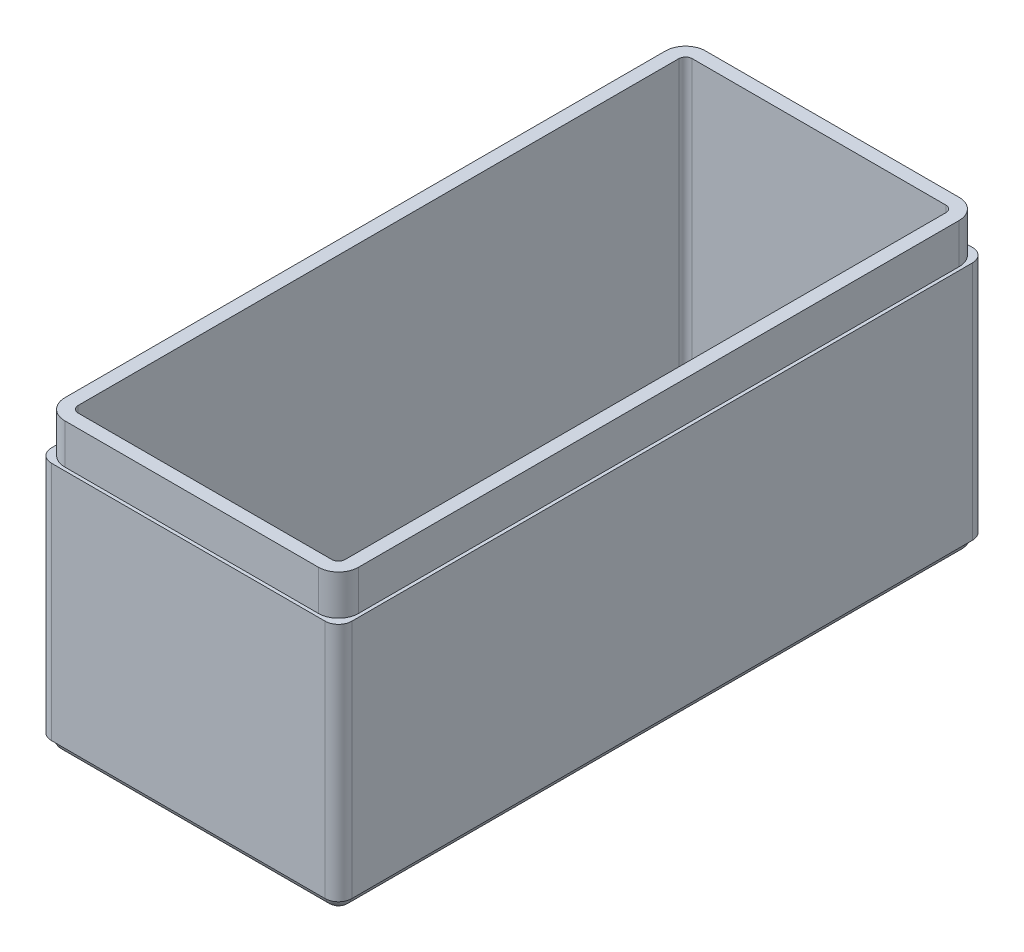
ISO-10303-21;
HEADER;
FILE_DESCRIPTION(('STEP AP214'),'2;1');
FILE_NAME('part.step','',(''),(''),'','','');
FILE_SCHEMA(('AUTOMOTIVE_DESIGN { 1 0 10303 214 1 1 1 1 }'));
ENDSEC;
DATA;
#1=APPLICATION_CONTEXT('core data for automotive mechanical design processes');
#2=APPLICATION_PROTOCOL_DEFINITION('international standard','automotive_design',2000,#1);
#3=PRODUCT_CONTEXT('',#1,'mechanical');
#4=PRODUCT('Part','Part','',(#3));
#5=PRODUCT_RELATED_PRODUCT_CATEGORY('part','',(#4));
#6=PRODUCT_DEFINITION_FORMATION('','',#4);
#7=PRODUCT_DEFINITION_CONTEXT('part definition',#1,'design');
#8=PRODUCT_DEFINITION('design','',#6,#7);
#9=PRODUCT_DEFINITION_SHAPE('','',#8);
#10=(LENGTH_UNIT() NAMED_UNIT(*) SI_UNIT(.MILLI.,.METRE.));
#11=(NAMED_UNIT(*) PLANE_ANGLE_UNIT() SI_UNIT($,.RADIAN.));
#12=(NAMED_UNIT(*) SI_UNIT($,.STERADIAN.) SOLID_ANGLE_UNIT());
#13=UNCERTAINTY_MEASURE_WITH_UNIT(LENGTH_MEASURE(1.E-05),#10,'distance_accuracy_value','');
#14=(GEOMETRIC_REPRESENTATION_CONTEXT(3) GLOBAL_UNCERTAINTY_ASSIGNED_CONTEXT((#13)) GLOBAL_UNIT_ASSIGNED_CONTEXT((#10,
#11,#12)) REPRESENTATION_CONTEXT('',''));
#15=CARTESIAN_POINT('',(0.,0.,0.));
#16=DIRECTION('',(0.,0.,1.));
#17=DIRECTION('',(1.,0.,0.));
#18=AXIS2_PLACEMENT_3D('',#15,#16,#17);
#19=CARTESIAN_POINT('',(22.5,19.,-48.5));
#20=DIRECTION('',(-1.,0.,0.));
#21=DIRECTION('',(0.,0.,1.));
#22=AXIS2_PLACEMENT_3D('',#19,#20,#21);
#23=PLANE('',#22);
#24=DIRECTION('',(0.,0.,-1.));
#25=VECTOR('',#24,1.);
#26=CARTESIAN_POINT('',(22.5,19.,-48.5));
#27=LINE('',#26,#25);
#28=CARTESIAN_POINT('',(22.5,19.,46.5));
#29=VERTEX_POINT('',#28);
#30=CARTESIAN_POINT('',(22.5,19.,-46.5));
#31=VERTEX_POINT('',#30);
#32=EDGE_CURVE('E379',#29,#31,#27,.T.);
#33=ORIENTED_EDGE('',*,*,#32,.F.);
#34=DIRECTION('',(0.,-1.,0.));
#35=VECTOR('',#34,1.);
#36=CARTESIAN_POINT('',(22.5,19.,46.5));
#37=LINE('',#36,#35);
#38=CARTESIAN_POINT('',(22.5,-17.,46.5));
#39=VERTEX_POINT('',#38);
#40=EDGE_CURVE('E554',#29,#39,#37,.T.);
#41=ORIENTED_EDGE('',*,*,#40,.T.);
#42=DIRECTION('',(0.,0.,1.));
#43=VECTOR('',#42,1.);
#44=CARTESIAN_POINT('',(22.5,-17.,-48.5));
#45=LINE('',#44,#43);
#46=CARTESIAN_POINT('',(22.5,-17.,-46.5));
#47=VERTEX_POINT('',#46);
#48=EDGE_CURVE('E349',#47,#39,#45,.T.);
#49=ORIENTED_EDGE('',*,*,#48,.F.);
#50=DIRECTION('',(0.,-1.,0.));
#51=VECTOR('',#50,1.);
#52=CARTESIAN_POINT('',(22.5,19.,-46.5));
#53=LINE('',#52,#51);
#54=EDGE_CURVE('E551',#47,#31,#53,.F.);
#55=ORIENTED_EDGE('',*,*,#54,.T.);
#56=EDGE_LOOP('',(#33,#41,#49,#55));
#57=FACE_BOUND('',#56,.T.);
#58=ADVANCED_FACE('F38',(#57),#23,.F.);
#59=CARTESIAN_POINT('',(-22.5,19.,-48.5));
#60=DIRECTION('',(0.,0.,1.));
#61=DIRECTION('',(1.,0.,0.));
#62=AXIS2_PLACEMENT_3D('',#59,#60,#61);
#63=PLANE('',#62);
#64=DIRECTION('',(1.,0.,0.));
#65=VECTOR('',#64,1.);
#66=CARTESIAN_POINT('',(-22.5,-17.,-48.5));
#67=LINE('',#66,#65);
#68=CARTESIAN_POINT('',(-20.5,-17.,-48.5));
#69=VERTEX_POINT('',#68);
#70=CARTESIAN_POINT('',(20.5,-17.,-48.5));
#71=VERTEX_POINT('',#70);
#72=EDGE_CURVE('E345',#69,#71,#67,.T.);
#73=ORIENTED_EDGE('',*,*,#72,.F.);
#74=DIRECTION('',(0.,-1.,0.));
#75=VECTOR('',#74,1.);
#76=CARTESIAN_POINT('',(-20.5,19.,-48.5));
#77=LINE('',#76,#75);
#78=CARTESIAN_POINT('',(-20.5,19.,-48.5));
#79=VERTEX_POINT('',#78);
#80=EDGE_CURVE('E11',#69,#79,#77,.F.);
#81=ORIENTED_EDGE('',*,*,#80,.T.);
#82=DIRECTION('',(-1.,0.,0.));
#83=VECTOR('',#82,1.);
#84=CARTESIAN_POINT('',(-22.5,19.,-48.5));
#85=LINE('',#84,#83);
#86=CARTESIAN_POINT('',(20.5,19.,-48.5));
#87=VERTEX_POINT('',#86);
#88=EDGE_CURVE('E397',#87,#79,#85,.T.);
#89=ORIENTED_EDGE('',*,*,#88,.F.);
#90=DIRECTION('',(0.,-1.,0.));
#91=VECTOR('',#90,1.);
#92=CARTESIAN_POINT('',(20.5,19.,-48.5));
#93=LINE('',#92,#91);
#94=EDGE_CURVE('E47',#87,#71,#93,.T.);
#95=ORIENTED_EDGE('',*,*,#94,.T.);
#96=EDGE_LOOP('',(#73,#81,#89,#95));
#97=FACE_BOUND('',#96,.T.);
#98=ADVANCED_FACE('F563',(#97),#63,.F.);
#99=CARTESIAN_POINT('',(-22.5,19.,-48.5));
#100=DIRECTION('',(1.,0.,0.));
#101=DIRECTION('',(0.,0.,-1.));
#102=AXIS2_PLACEMENT_3D('',#99,#100,#101);
#103=PLANE('',#102);
#104=DIRECTION('',(0.,0.,-1.));
#105=VECTOR('',#104,1.);
#106=CARTESIAN_POINT('',(-22.5,-17.,48.5));
#107=LINE('',#106,#105);
#108=CARTESIAN_POINT('',(-22.5,-17.,46.5));
#109=VERTEX_POINT('',#108);
#110=CARTESIAN_POINT('',(-22.5,-17.,-46.5));
#111=VERTEX_POINT('',#110);
#112=EDGE_CURVE('E357',#109,#111,#107,.T.);
#113=ORIENTED_EDGE('',*,*,#112,.F.);
#114=DIRECTION('',(0.,-1.,0.));
#115=VECTOR('',#114,1.);
#116=CARTESIAN_POINT('',(-22.5,19.,46.5));
#117=LINE('',#116,#115);
#118=CARTESIAN_POINT('',(-22.5,19.,46.5));
#119=VERTEX_POINT('',#118);
#120=EDGE_CURVE('E536',#109,#119,#117,.F.);
#121=ORIENTED_EDGE('',*,*,#120,.T.);
#122=DIRECTION('',(0.,0.,1.));
#123=VECTOR('',#122,1.);
#124=CARTESIAN_POINT('',(-22.5,19.,-48.5));
#125=LINE('',#124,#123);
#126=CARTESIAN_POINT('',(-22.5,19.,-46.5));
#127=VERTEX_POINT('',#126);
#128=EDGE_CURVE('E401',#127,#119,#125,.T.);
#129=ORIENTED_EDGE('',*,*,#128,.F.);
#130=DIRECTION('',(0.,-1.,0.));
#131=VECTOR('',#130,1.);
#132=CARTESIAN_POINT('',(-22.5,19.,-46.5));
#133=LINE('',#132,#131);
#134=EDGE_CURVE('E532',#127,#111,#133,.T.);
#135=ORIENTED_EDGE('',*,*,#134,.T.);
#136=EDGE_LOOP('',(#113,#121,#129,#135));
#137=FACE_BOUND('',#136,.T.);
#138=ADVANCED_FACE('F577',(#137),#103,.F.);
#139=CARTESIAN_POINT('',(-22.5,19.,48.5));
#140=DIRECTION('',(0.,0.,-1.));
#141=DIRECTION('',(-1.,0.,0.));
#142=AXIS2_PLACEMENT_3D('',#139,#140,#141);
#143=PLANE('',#142);
#144=DIRECTION('',(1.,0.,0.));
#145=VECTOR('',#144,1.);
#146=CARTESIAN_POINT('',(-22.5,19.,48.5));
#147=LINE('',#146,#145);
#148=CARTESIAN_POINT('',(-20.5,19.,48.5));
#149=VERTEX_POINT('',#148);
#150=CARTESIAN_POINT('',(20.5,19.,48.5));
#151=VERTEX_POINT('',#150);
#152=EDGE_CURVE('E405',#149,#151,#147,.T.);
#153=ORIENTED_EDGE('',*,*,#152,.F.);
#154=DIRECTION('',(0.,-1.,0.));
#155=VECTOR('',#154,1.);
#156=CARTESIAN_POINT('',(-20.5,19.,48.5));
#157=LINE('',#156,#155);
#158=CARTESIAN_POINT('',(-20.5,-17.,48.5));
#159=VERTEX_POINT('',#158);
#160=EDGE_CURVE('E516',#149,#159,#157,.T.);
#161=ORIENTED_EDGE('',*,*,#160,.T.);
#162=DIRECTION('',(-1.,0.,0.));
#163=VECTOR('',#162,1.);
#164=CARTESIAN_POINT('',(22.5,-17.,48.5));
#165=LINE('',#164,#163);
#166=CARTESIAN_POINT('',(20.5,-17.,48.5));
#167=VERTEX_POINT('',#166);
#168=EDGE_CURVE('E353',#167,#159,#165,.T.);
#169=ORIENTED_EDGE('',*,*,#168,.F.);
#170=DIRECTION('',(0.,-1.,0.));
#171=VECTOR('',#170,1.);
#172=CARTESIAN_POINT('',(20.5,19.,48.5));
#173=LINE('',#172,#171);
#174=EDGE_CURVE('E513',#167,#151,#173,.F.);
#175=ORIENTED_EDGE('',*,*,#174,.T.);
#176=EDGE_LOOP('',(#153,#161,#169,#175));
#177=FACE_BOUND('',#176,.T.);
#178=ADVANCED_FACE('F588',(#177),#143,.F.);
#179=CARTESIAN_POINT('',(0.,19.,0.));
#180=DIRECTION('',(0.,1.,0.));
#181=DIRECTION('',(0.,0.,1.));
#182=AXIS2_PLACEMENT_3D('',#179,#180,#181);
#183=PLANE('',#182);
#184=DIRECTION('',(0.,0.,-1.));
#185=VECTOR('',#184,1.);
#186=CARTESIAN_POINT('',(22.,19.,-48.));
#187=LINE('',#186,#185);
#188=CARTESIAN_POINT('',(22.,19.,45.));
#189=VERTEX_POINT('',#188);
#190=CARTESIAN_POINT('',(22.,19.,-45.));
#191=VERTEX_POINT('',#190);
#192=EDGE_CURVE('E361',#189,#191,#187,.T.);
#193=ORIENTED_EDGE('',*,*,#192,.F.);
#194=CARTESIAN_POINT('',(19.,19.,45.));
#195=DIRECTION('',(0.,1.,0.));
#196=DIRECTION('',(0.,0.,1.));
#197=AXIS2_PLACEMENT_3D('',#194,#195,#196);
#198=CIRCLE('',#197,3.);
#199=CARTESIAN_POINT('',(19.,19.,48.));
#200=VERTEX_POINT('',#199);
#201=EDGE_CURVE('E504',#189,#200,#198,.F.);
#202=ORIENTED_EDGE('',*,*,#201,.T.);
#203=DIRECTION('',(1.,0.,0.));
#204=VECTOR('',#203,1.);
#205=CARTESIAN_POINT('',(-22.,19.,48.));
#206=LINE('',#205,#204);
#207=CARTESIAN_POINT('',(-19.,19.,48.));
#208=VERTEX_POINT('',#207);
#209=EDGE_CURVE('E367',#208,#200,#206,.T.);
#210=ORIENTED_EDGE('',*,*,#209,.F.);
#211=CARTESIAN_POINT('',(-19.,19.,45.));
#212=DIRECTION('',(0.,1.,0.));
#213=DIRECTION('',(0.,0.,1.));
#214=AXIS2_PLACEMENT_3D('',#211,#212,#213);
#215=CIRCLE('',#214,3.);
#216=CARTESIAN_POINT('',(-22.,19.,45.));
#217=VERTEX_POINT('',#216);
#218=EDGE_CURVE('E501',#208,#217,#215,.F.);
#219=ORIENTED_EDGE('',*,*,#218,.T.);
#220=DIRECTION('',(0.,0.,1.));
#221=VECTOR('',#220,1.);
#222=CARTESIAN_POINT('',(-22.,19.,-48.));
#223=LINE('',#222,#221);
#224=CARTESIAN_POINT('',(-22.,19.,-45.));
#225=VERTEX_POINT('',#224);
#226=EDGE_CURVE('E387',#225,#217,#223,.T.);
#227=ORIENTED_EDGE('',*,*,#226,.F.);
#228=CARTESIAN_POINT('',(-19.,19.,-45.));
#229=DIRECTION('',(0.,1.,0.));
#230=DIRECTION('',(0.,0.,1.));
#231=AXIS2_PLACEMENT_3D('',#228,#229,#230);
#232=CIRCLE('',#231,3.);
#233=CARTESIAN_POINT('',(-19.,19.,-48.));
#234=VERTEX_POINT('',#233);
#235=EDGE_CURVE('E510',#225,#234,#232,.F.);
#236=ORIENTED_EDGE('',*,*,#235,.T.);
#237=DIRECTION('',(-1.,0.,0.));
#238=VECTOR('',#237,1.);
#239=CARTESIAN_POINT('',(-22.,19.,-48.));
#240=LINE('',#239,#238);
#241=CARTESIAN_POINT('',(19.,19.,-48.));
#242=VERTEX_POINT('',#241);
#243=EDGE_CURVE('E383',#242,#234,#240,.T.);
#244=ORIENTED_EDGE('',*,*,#243,.F.);
#245=CARTESIAN_POINT('',(19.,19.,-45.));
#246=DIRECTION('',(0.,1.,0.));
#247=DIRECTION('',(0.,0.,1.));
#248=AXIS2_PLACEMENT_3D('',#245,#246,#247);
#249=CIRCLE('',#248,3.);
#250=EDGE_CURVE('E507',#242,#191,#249,.F.);
#251=ORIENTED_EDGE('',*,*,#250,.T.);
#252=EDGE_LOOP('',(#193,#202,#210,#219,#227,#236,#244,#251));
#253=FACE_BOUND('',#252,.T.);
#254=ORIENTED_EDGE('',*,*,#128,.T.);
#255=CARTESIAN_POINT('',(-20.5,19.,46.5));
#256=DIRECTION('',(0.,1.,0.));
#257=DIRECTION('',(0.,0.,1.));
#258=AXIS2_PLACEMENT_3D('',#255,#256,#257);
#259=CIRCLE('',#258,2.);
#260=EDGE_CURVE('E548',#119,#149,#259,.T.);
#261=ORIENTED_EDGE('',*,*,#260,.T.);
#262=ORIENTED_EDGE('',*,*,#152,.T.);
#263=CARTESIAN_POINT('',(20.5,19.,46.5));
#264=DIRECTION('',(0.,1.,0.));
#265=DIRECTION('',(0.,0.,1.));
#266=AXIS2_PLACEMENT_3D('',#263,#264,#265);
#267=CIRCLE('',#266,2.);
#268=EDGE_CURVE('E545',#151,#29,#267,.T.);
#269=ORIENTED_EDGE('',*,*,#268,.T.);
#270=ORIENTED_EDGE('',*,*,#32,.T.);
#271=CARTESIAN_POINT('',(20.5,19.,-46.5));
#272=DIRECTION('',(0.,1.,0.));
#273=DIRECTION('',(0.,0.,1.));
#274=AXIS2_PLACEMENT_3D('',#271,#272,#273);
#275=CIRCLE('',#274,2.);
#276=EDGE_CURVE('E539',#31,#87,#275,.T.);
#277=ORIENTED_EDGE('',*,*,#276,.T.);
#278=ORIENTED_EDGE('',*,*,#88,.T.);
#279=CARTESIAN_POINT('',(-20.5,19.,-46.5));
#280=DIRECTION('',(0.,1.,0.));
#281=DIRECTION('',(0.,0.,1.));
#282=AXIS2_PLACEMENT_3D('',#279,#280,#281);
#283=CIRCLE('',#282,2.);
#284=EDGE_CURVE('E542',#79,#127,#283,.T.);
#285=ORIENTED_EDGE('',*,*,#284,.T.);
#286=EDGE_LOOP('',(#254,#261,#262,#269,#270,#277,#278,#285));
#287=FACE_BOUND('',#286,.T.);
#288=ADVANCED_FACE('F581',(#253,#287),#183,.T.);
#289=CARTESIAN_POINT('',(22.,25.,-48.));
#290=DIRECTION('',(-1.,0.,0.));
#291=DIRECTION('',(0.,0.,1.));
#292=AXIS2_PLACEMENT_3D('',#289,#290,#291);
#293=PLANE('',#292);
#294=DIRECTION('',(0.,0.,-1.));
#295=VECTOR('',#294,1.);
#296=CARTESIAN_POINT('',(22.,25.,-48.));
#297=LINE('',#296,#295);
#298=CARTESIAN_POINT('',(22.,25.,45.));
#299=VERTEX_POINT('',#298);
#300=CARTESIAN_POINT('',(22.,25.,-45.));
#301=VERTEX_POINT('',#300);
#302=EDGE_CURVE('E362',#299,#301,#297,.T.);
#303=ORIENTED_EDGE('',*,*,#302,.F.);
#304=DIRECTION('',(0.,-1.,0.));
#305=VECTOR('',#304,1.);
#306=CARTESIAN_POINT('',(22.,25.,45.));
#307=LINE('',#306,#305);
#308=EDGE_CURVE('E490',#299,#189,#307,.T.);
#309=ORIENTED_EDGE('',*,*,#308,.T.);
#310=ORIENTED_EDGE('',*,*,#192,.T.);
#311=DIRECTION('',(0.,-1.,0.));
#312=VECTOR('',#311,1.);
#313=CARTESIAN_POINT('',(22.,25.,-45.));
#314=LINE('',#313,#312);
#315=EDGE_CURVE('E487',#191,#301,#314,.F.);
#316=ORIENTED_EDGE('',*,*,#315,.T.);
#317=EDGE_LOOP('',(#303,#309,#310,#316));
#318=FACE_BOUND('',#317,.T.);
#319=ADVANCED_FACE('F957',(#318),#293,.F.);
#320=CARTESIAN_POINT('',(-22.,25.,-48.));
#321=DIRECTION('',(0.,0.,1.));
#322=DIRECTION('',(1.,0.,0.));
#323=AXIS2_PLACEMENT_3D('',#320,#321,#322);
#324=PLANE('',#323);
#325=DIRECTION('',(-1.,0.,0.));
#326=VECTOR('',#325,1.);
#327=CARTESIAN_POINT('',(-22.,25.,-48.));
#328=LINE('',#327,#326);
#329=CARTESIAN_POINT('',(19.,25.,-48.));
#330=VERTEX_POINT('',#329);
#331=CARTESIAN_POINT('',(-19.,25.,-48.));
#332=VERTEX_POINT('',#331);
#333=EDGE_CURVE('E366',#330,#332,#328,.T.);
#334=ORIENTED_EDGE('',*,*,#333,.F.);
#335=DIRECTION('',(0.,-1.,0.));
#336=VECTOR('',#335,1.);
#337=CARTESIAN_POINT('',(19.,25.,-48.));
#338=LINE('',#337,#336);
#339=EDGE_CURVE('E497',#330,#242,#338,.T.);
#340=ORIENTED_EDGE('',*,*,#339,.T.);
#341=ORIENTED_EDGE('',*,*,#243,.T.);
#342=DIRECTION('',(0.,-1.,0.));
#343=VECTOR('',#342,1.);
#344=CARTESIAN_POINT('',(-19.,25.,-48.));
#345=LINE('',#344,#343);
#346=EDGE_CURVE('E494',#234,#332,#345,.F.);
#347=ORIENTED_EDGE('',*,*,#346,.T.);
#348=EDGE_LOOP('',(#334,#340,#341,#347));
#349=FACE_BOUND('',#348,.T.);
#350=ADVANCED_FACE('F947',(#349),#324,.F.);
#351=CARTESIAN_POINT('',(-22.,25.,-48.));
#352=DIRECTION('',(1.,0.,0.));
#353=DIRECTION('',(0.,0.,-1.));
#354=AXIS2_PLACEMENT_3D('',#351,#352,#353);
#355=PLANE('',#354);
#356=ORIENTED_EDGE('',*,*,#226,.T.);
#357=DIRECTION('',(0.,-1.,0.));
#358=VECTOR('',#357,1.);
#359=CARTESIAN_POINT('',(-22.,25.,45.));
#360=LINE('',#359,#358);
#361=CARTESIAN_POINT('',(-22.,25.,45.));
#362=VERTEX_POINT('',#361);
#363=EDGE_CURVE('E472',#217,#362,#360,.F.);
#364=ORIENTED_EDGE('',*,*,#363,.T.);
#365=DIRECTION('',(0.,0.,1.));
#366=VECTOR('',#365,1.);
#367=CARTESIAN_POINT('',(-22.,25.,-48.));
#368=LINE('',#367,#366);
#369=CARTESIAN_POINT('',(-22.,25.,-45.));
#370=VERTEX_POINT('',#369);
#371=EDGE_CURVE('E371',#370,#362,#368,.T.);
#372=ORIENTED_EDGE('',*,*,#371,.F.);
#373=DIRECTION('',(0.,-1.,0.));
#374=VECTOR('',#373,1.);
#375=CARTESIAN_POINT('',(-22.,25.,-45.));
#376=LINE('',#375,#374);
#377=EDGE_CURVE('E468',#370,#225,#376,.T.);
#378=ORIENTED_EDGE('',*,*,#377,.T.);
#379=EDGE_LOOP('',(#356,#364,#372,#378));
#380=FACE_BOUND('',#379,.T.);
#381=ADVANCED_FACE('F937',(#380),#355,.F.);
#382=CARTESIAN_POINT('',(-22.,25.,48.));
#383=DIRECTION('',(0.,0.,-1.));
#384=DIRECTION('',(-1.,0.,0.));
#385=AXIS2_PLACEMENT_3D('',#382,#383,#384);
#386=PLANE('',#385);
#387=DIRECTION('',(1.,0.,0.));
#388=VECTOR('',#387,1.);
#389=CARTESIAN_POINT('',(-22.,25.,48.));
#390=LINE('',#389,#388);
#391=CARTESIAN_POINT('',(-19.,25.,48.));
#392=VERTEX_POINT('',#391);
#393=CARTESIAN_POINT('',(19.,25.,48.));
#394=VERTEX_POINT('',#393);
#395=EDGE_CURVE('E375',#392,#394,#390,.T.);
#396=ORIENTED_EDGE('',*,*,#395,.F.);
#397=DIRECTION('',(0.,-1.,0.));
#398=VECTOR('',#397,1.);
#399=CARTESIAN_POINT('',(-19.,25.,48.));
#400=LINE('',#399,#398);
#401=EDGE_CURVE('E464',#392,#208,#400,.T.);
#402=ORIENTED_EDGE('',*,*,#401,.T.);
#403=ORIENTED_EDGE('',*,*,#209,.T.);
#404=DIRECTION('',(0.,-1.,0.));
#405=VECTOR('',#404,1.);
#406=CARTESIAN_POINT('',(19.,25.,48.));
#407=LINE('',#406,#405);
#408=EDGE_CURVE('E433',#200,#394,#407,.F.);
#409=ORIENTED_EDGE('',*,*,#408,.T.);
#410=EDGE_LOOP('',(#396,#402,#403,#409));
#411=FACE_BOUND('',#410,.T.);
#412=ADVANCED_FACE('F928',(#411),#386,.F.);
#413=CARTESIAN_POINT('',(0.,25.,0.));
#414=DIRECTION('',(0.,1.,0.));
#415=DIRECTION('',(0.,0.,1.));
#416=AXIS2_PLACEMENT_3D('',#413,#414,#415);
#417=PLANE('',#416);
#418=DIRECTION('',(0.,0.,1.));
#419=VECTOR('',#418,1.);
#420=CARTESIAN_POINT('',(-20.,25.,-48.));
#421=LINE('',#420,#419);
#422=CARTESIAN_POINT('',(-20.,25.,-45.));
#423=VERTEX_POINT('',#422);
#424=CARTESIAN_POINT('',(-20.,25.,45.));
#425=VERTEX_POINT('',#424);
#426=EDGE_CURVE('E315',#423,#425,#421,.T.);
#427=ORIENTED_EDGE('',*,*,#426,.F.);
#428=CARTESIAN_POINT('',(-19.,25.,-45.));
#429=DIRECTION('',(0.,1.,0.));
#430=DIRECTION('',(0.,0.,1.));
#431=AXIS2_PLACEMENT_3D('',#428,#429,#430);
#432=CIRCLE('',#431,1.);
#433=CARTESIAN_POINT('',(-19.,25.,-46.));
#434=VERTEX_POINT('',#433);
#435=EDGE_CURVE('E302',#434,#423,#432,.T.);
#436=ORIENTED_EDGE('',*,*,#435,.F.);
#437=DIRECTION('',(-1.,0.,0.));
#438=VECTOR('',#437,1.);
#439=CARTESIAN_POINT('',(-22.,25.,-46.));
#440=LINE('',#439,#438);
#441=CARTESIAN_POINT('',(19.,25.,-46.));
#442=VERTEX_POINT('',#441);
#443=EDGE_CURVE('E309',#442,#434,#440,.T.);
#444=ORIENTED_EDGE('',*,*,#443,.F.);
#445=CARTESIAN_POINT('',(19.,25.,-45.));
#446=DIRECTION('',(0.,1.,0.));
#447=DIRECTION('',(0.,0.,1.));
#448=AXIS2_PLACEMENT_3D('',#445,#446,#447);
#449=CIRCLE('',#448,1.);
#450=CARTESIAN_POINT('',(20.,25.,-45.));
#451=VERTEX_POINT('',#450);
#452=EDGE_CURVE('E242',#451,#442,#449,.T.);
#453=ORIENTED_EDGE('',*,*,#452,.F.);
#454=DIRECTION('',(0.,0.,-1.));
#455=VECTOR('',#454,1.);
#456=CARTESIAN_POINT('',(20.,25.,-48.));
#457=LINE('',#456,#455);
#458=CARTESIAN_POINT('',(20.,25.,45.));
#459=VERTEX_POINT('',#458);
#460=EDGE_CURVE('E272',#459,#451,#457,.T.);
#461=ORIENTED_EDGE('',*,*,#460,.F.);
#462=CARTESIAN_POINT('',(19.,25.,45.));
#463=DIRECTION('',(0.,1.,0.));
#464=DIRECTION('',(0.,0.,1.));
#465=AXIS2_PLACEMENT_3D('',#462,#463,#464);
#466=CIRCLE('',#465,1.);
#467=CARTESIAN_POINT('',(19.,25.,46.));
#468=VERTEX_POINT('',#467);
#469=EDGE_CURVE('E312',#468,#459,#466,.T.);
#470=ORIENTED_EDGE('',*,*,#469,.F.);
#471=DIRECTION('',(1.,0.,0.));
#472=VECTOR('',#471,1.);
#473=CARTESIAN_POINT('',(-22.,25.,46.));
#474=LINE('',#473,#472);
#475=CARTESIAN_POINT('',(-19.,25.,46.));
#476=VERTEX_POINT('',#475);
#477=EDGE_CURVE('E296',#476,#468,#474,.T.);
#478=ORIENTED_EDGE('',*,*,#477,.F.);
#479=CARTESIAN_POINT('',(-19.,25.,45.));
#480=DIRECTION('',(0.,1.,0.));
#481=DIRECTION('',(0.,0.,1.));
#482=AXIS2_PLACEMENT_3D('',#479,#480,#481);
#483=CIRCLE('',#482,1.);
#484=EDGE_CURVE('E291',#425,#476,#483,.T.);
#485=ORIENTED_EDGE('',*,*,#484,.F.);
#486=EDGE_LOOP('',(#427,#436,#444,#453,#461,#470,#478,#485));
#487=FACE_BOUND('',#486,.T.);
#488=ORIENTED_EDGE('',*,*,#371,.T.);
#489=CARTESIAN_POINT('',(-19.,25.,45.));
#490=DIRECTION('',(0.,1.,0.));
#491=DIRECTION('',(0.,0.,1.));
#492=AXIS2_PLACEMENT_3D('',#489,#490,#491);
#493=CIRCLE('',#492,3.);
#494=EDGE_CURVE('E484',#362,#392,#493,.T.);
#495=ORIENTED_EDGE('',*,*,#494,.T.);
#496=ORIENTED_EDGE('',*,*,#395,.T.);
#497=CARTESIAN_POINT('',(19.,25.,45.));
#498=DIRECTION('',(0.,1.,0.));
#499=DIRECTION('',(0.,0.,1.));
#500=AXIS2_PLACEMENT_3D('',#497,#498,#499);
#501=CIRCLE('',#500,3.);
#502=EDGE_CURVE('E481',#394,#299,#501,.T.);
#503=ORIENTED_EDGE('',*,*,#502,.T.);
#504=ORIENTED_EDGE('',*,*,#302,.T.);
#505=CARTESIAN_POINT('',(19.,25.,-45.));
#506=DIRECTION('',(0.,1.,0.));
#507=DIRECTION('',(0.,0.,1.));
#508=AXIS2_PLACEMENT_3D('',#505,#506,#507);
#509=CIRCLE('',#508,3.);
#510=EDGE_CURVE('E478',#301,#330,#509,.T.);
#511=ORIENTED_EDGE('',*,*,#510,.T.);
#512=ORIENTED_EDGE('',*,*,#333,.T.);
#513=CARTESIAN_POINT('',(-19.,25.,-45.));
#514=DIRECTION('',(0.,1.,0.));
#515=DIRECTION('',(0.,0.,1.));
#516=AXIS2_PLACEMENT_3D('',#513,#514,#515);
#517=CIRCLE('',#516,3.);
#518=EDGE_CURVE('E475',#332,#370,#517,.T.);
#519=ORIENTED_EDGE('',*,*,#518,.T.);
#520=EDGE_LOOP('',(#488,#495,#496,#503,#504,#511,#512,#519));
#521=FACE_BOUND('',#520,.T.);
#522=ADVANCED_FACE('F885',(#487,#521),#417,.T.);
#523=CARTESIAN_POINT('',(0.,-17.,0.));
#524=DIRECTION('',(0.,-1.,0.));
#525=DIRECTION('',(0.,0.,-1.));
#526=AXIS2_PLACEMENT_3D('',#523,#524,#525);
#527=PLANE('',#526);
#528=DIRECTION('',(1.,0.,0.));
#529=VECTOR('',#528,1.);
#530=CARTESIAN_POINT('',(-22.,-17.,-48.));
#531=LINE('',#530,#529);
#532=CARTESIAN_POINT('',(-20.,-17.,-48.));
#533=VERTEX_POINT('',#532);
#534=CARTESIAN_POINT('',(20.,-17.,-48.));
#535=VERTEX_POINT('',#534);
#536=EDGE_CURVE('E341',#533,#535,#531,.T.);
#537=ORIENTED_EDGE('',*,*,#536,.F.);
#538=CARTESIAN_POINT('',(-20.,-17.,-46.));
#539=DIRECTION('',(0.,-1.,0.));
#540=DIRECTION('',(0.,0.,-1.));
#541=AXIS2_PLACEMENT_3D('',#538,#539,#540);
#542=CIRCLE('',#541,2.);
#543=CARTESIAN_POINT('',(-22.,-17.,-46.));
#544=VERTEX_POINT('',#543);
#545=EDGE_CURVE('E422',#533,#544,#542,.F.);
#546=ORIENTED_EDGE('',*,*,#545,.T.);
#547=DIRECTION('',(0.,0.,-1.));
#548=VECTOR('',#547,1.);
#549=CARTESIAN_POINT('',(-22.,-17.,48.));
#550=LINE('',#549,#548);
#551=CARTESIAN_POINT('',(-22.,-17.,46.));
#552=VERTEX_POINT('',#551);
#553=EDGE_CURVE('E337',#552,#544,#550,.T.);
#554=ORIENTED_EDGE('',*,*,#553,.F.);
#555=CARTESIAN_POINT('',(-20.,-17.,46.));
#556=DIRECTION('',(0.,-1.,0.));
#557=DIRECTION('',(0.,0.,-1.));
#558=AXIS2_PLACEMENT_3D('',#555,#556,#557);
#559=CIRCLE('',#558,2.);
#560=CARTESIAN_POINT('',(-20.,-17.,48.));
#561=VERTEX_POINT('',#560);
#562=EDGE_CURVE('E431',#552,#561,#559,.F.);
#563=ORIENTED_EDGE('',*,*,#562,.T.);
#564=DIRECTION('',(-1.,0.,0.));
#565=VECTOR('',#564,1.);
#566=CARTESIAN_POINT('',(-22.,-17.,48.));
#567=LINE('',#566,#565);
#568=CARTESIAN_POINT('',(20.,-17.,48.));
#569=VERTEX_POINT('',#568);
#570=EDGE_CURVE('E332',#569,#561,#567,.T.);
#571=ORIENTED_EDGE('',*,*,#570,.F.);
#572=CARTESIAN_POINT('',(20.,-17.,46.));
#573=DIRECTION('',(0.,-1.,0.));
#574=DIRECTION('',(0.,0.,-1.));
#575=AXIS2_PLACEMENT_3D('',#572,#573,#574);
#576=CIRCLE('',#575,2.);
#577=CARTESIAN_POINT('',(22.,-17.,46.));
#578=VERTEX_POINT('',#577);
#579=EDGE_CURVE('E428',#569,#578,#576,.F.);
#580=ORIENTED_EDGE('',*,*,#579,.T.);
#581=DIRECTION('',(0.,0.,1.));
#582=VECTOR('',#581,1.);
#583=CARTESIAN_POINT('',(22.,-17.,48.));
#584=LINE('',#583,#582);
#585=CARTESIAN_POINT('',(22.,-17.,-46.));
#586=VERTEX_POINT('',#585);
#587=EDGE_CURVE('E328',#586,#578,#584,.T.);
#588=ORIENTED_EDGE('',*,*,#587,.F.);
#589=CARTESIAN_POINT('',(20.,-17.,-46.));
#590=DIRECTION('',(0.,-1.,0.));
#591=DIRECTION('',(0.,0.,-1.));
#592=AXIS2_PLACEMENT_3D('',#589,#590,#591);
#593=CIRCLE('',#592,2.);
#594=EDGE_CURVE('E425',#586,#535,#593,.F.);
#595=ORIENTED_EDGE('',*,*,#594,.T.);
#596=EDGE_LOOP('',(#537,#546,#554,#563,#571,#580,#588,#595));
#597=FACE_BOUND('',#596,.T.);
#598=ORIENTED_EDGE('',*,*,#168,.T.);
#599=CARTESIAN_POINT('',(-20.5,-17.,46.5));
#600=DIRECTION('',(0.,-1.,0.));
#601=DIRECTION('',(0.,0.,-1.));
#602=AXIS2_PLACEMENT_3D('',#599,#600,#601);
#603=CIRCLE('',#602,2.);
#604=EDGE_CURVE('E529',#159,#109,#603,.T.);
#605=ORIENTED_EDGE('',*,*,#604,.T.);
#606=ORIENTED_EDGE('',*,*,#112,.T.);
#607=CARTESIAN_POINT('',(-20.5,-17.,-46.5));
#608=DIRECTION('',(0.,-1.,0.));
#609=DIRECTION('',(0.,0.,-1.));
#610=AXIS2_PLACEMENT_3D('',#607,#608,#609);
#611=CIRCLE('',#610,2.);
#612=EDGE_CURVE('E523',#111,#69,#611,.T.);
#613=ORIENTED_EDGE('',*,*,#612,.T.);
#614=ORIENTED_EDGE('',*,*,#72,.T.);
#615=CARTESIAN_POINT('',(20.5,-17.,-46.5));
#616=DIRECTION('',(0.,-1.,0.));
#617=DIRECTION('',(0.,0.,-1.));
#618=AXIS2_PLACEMENT_3D('',#615,#616,#617);
#619=CIRCLE('',#618,2.);
#620=EDGE_CURVE('E520',#71,#47,#619,.T.);
#621=ORIENTED_EDGE('',*,*,#620,.T.);
#622=ORIENTED_EDGE('',*,*,#48,.T.);
#623=CARTESIAN_POINT('',(20.5,-17.,46.5));
#624=DIRECTION('',(0.,-1.,0.));
#625=DIRECTION('',(0.,0.,-1.));
#626=AXIS2_PLACEMENT_3D('',#623,#624,#625);
#627=CIRCLE('',#626,2.);
#628=EDGE_CURVE('E526',#39,#167,#627,.T.);
#629=ORIENTED_EDGE('',*,*,#628,.T.);
#630=EDGE_LOOP('',(#598,#605,#606,#613,#614,#621,#622,#629));
#631=FACE_BOUND('',#630,.T.);
#632=ADVANCED_FACE('F568',(#597,#631),#527,.T.);
#633=CARTESIAN_POINT('',(0.,-19.,0.));
#634=DIRECTION('',(0.,1.,0.));
#635=DIRECTION('',(0.,0.,1.));
#636=AXIS2_PLACEMENT_3D('',#633,#634,#635);
#637=PLANE('',#636);
#638=DIRECTION('',(0.,0.,-1.));
#639=VECTOR('',#638,1.);
#640=CARTESIAN_POINT('',(-20.,-19.,-48.));
#641=LINE('',#640,#639);
#642=CARTESIAN_POINT('',(-20.,-19.,46.));
#643=VERTEX_POINT('',#642);
#644=CARTESIAN_POINT('',(-20.,-19.,-46.));
#645=VERTEX_POINT('',#644);
#646=EDGE_CURVE('E415',#643,#645,#641,.T.);
#647=ORIENTED_EDGE('',*,*,#646,.T.);
#648=DIRECTION('',(1.,0.,0.));
#649=VECTOR('',#648,1.);
#650=CARTESIAN_POINT('',(22.,-19.,-46.));
#651=LINE('',#650,#649);
#652=CARTESIAN_POINT('',(20.,-19.,-46.));
#653=VERTEX_POINT('',#652);
#654=EDGE_CURVE('E418',#645,#653,#651,.T.);
#655=ORIENTED_EDGE('',*,*,#654,.T.);
#656=DIRECTION('',(0.,0.,1.));
#657=VECTOR('',#656,1.);
#658=CARTESIAN_POINT('',(20.,-19.,48.));
#659=LINE('',#658,#657);
#660=CARTESIAN_POINT('',(20.,-19.,46.));
#661=VERTEX_POINT('',#660);
#662=EDGE_CURVE('E409',#653,#661,#659,.T.);
#663=ORIENTED_EDGE('',*,*,#662,.T.);
#664=DIRECTION('',(-1.,0.,0.));
#665=VECTOR('',#664,1.);
#666=CARTESIAN_POINT('',(-22.,-19.,46.));
#667=LINE('',#666,#665);
#668=EDGE_CURVE('E412',#661,#643,#667,.T.);
#669=ORIENTED_EDGE('',*,*,#668,.T.);
#670=EDGE_LOOP('',(#647,#655,#663,#669));
#671=FACE_BOUND('',#670,.T.);
#672=ADVANCED_FACE('F644',(#671),#637,.F.);
#673=CARTESIAN_POINT('',(0.,-17.,46.));
#674=DIRECTION('',(1.,0.,0.));
#675=DIRECTION('',(0.,0.,-1.));
#676=AXIS2_PLACEMENT_3D('',#673,#674,#675);
#677=CYLINDRICAL_SURFACE('',#676,2.);
#678=CARTESIAN_POINT('',(20.,-17.,46.));
#679=DIRECTION('',(1.,0.,0.));
#680=DIRECTION('',(0.,0.,-1.));
#681=AXIS2_PLACEMENT_3D('',#678,#679,#680);
#682=CIRCLE('',#681,2.);
#683=EDGE_CURVE('E455',#569,#661,#682,.T.);
#684=ORIENTED_EDGE('',*,*,#683,.F.);
#685=ORIENTED_EDGE('',*,*,#570,.T.);
#686=CARTESIAN_POINT('',(-20.,-17.,46.));
#687=DIRECTION('',(-1.,0.,0.));
#688=DIRECTION('',(0.,0.,1.));
#689=AXIS2_PLACEMENT_3D('',#686,#687,#688);
#690=CIRCLE('',#689,2.);
#691=EDGE_CURVE('E333',#643,#561,#690,.T.);
#692=ORIENTED_EDGE('',*,*,#691,.F.);
#693=ORIENTED_EDGE('',*,*,#668,.F.);
#694=EDGE_LOOP('',(#684,#685,#692,#693));
#695=FACE_BOUND('',#694,.T.);
#696=ADVANCED_FACE('F640',(#695),#677,.T.);
#697=CARTESIAN_POINT('',(-20.,-17.,46.));
#698=DIRECTION('',(0.,0.,1.));
#699=DIRECTION('',(1.,0.,0.));
#700=AXIS2_PLACEMENT_3D('',#697,#698,#699);
#701=SPHERICAL_SURFACE('',#700,2.);
#702=ORIENTED_EDGE('',*,*,#691,.T.);
#703=ORIENTED_EDGE('',*,*,#562,.F.);
#704=CARTESIAN_POINT('',(-20.,-17.,46.));
#705=DIRECTION('',(0.,0.,1.));
#706=DIRECTION('',(1.,0.,0.));
#707=AXIS2_PLACEMENT_3D('',#704,#705,#706);
#708=CIRCLE('',#707,2.);
#709=EDGE_CURVE('E451',#643,#552,#708,.F.);
#710=ORIENTED_EDGE('',*,*,#709,.F.);
#711=EDGE_LOOP('',(#702,#703,#710));
#712=FACE_BOUND('',#711,.T.);
#713=ADVANCED_FACE('F636',(#712),#701,.T.);
#714=CARTESIAN_POINT('',(20.,-17.,46.));
#715=DIRECTION('',(0.,0.,1.));
#716=DIRECTION('',(1.,0.,0.));
#717=AXIS2_PLACEMENT_3D('',#714,#715,#716);
#718=SPHERICAL_SURFACE('',#717,2.);
#719=ORIENTED_EDGE('',*,*,#579,.F.);
#720=ORIENTED_EDGE('',*,*,#683,.T.);
#721=CARTESIAN_POINT('',(20.,-17.,46.));
#722=DIRECTION('',(0.,0.,1.));
#723=DIRECTION('',(1.,0.,0.));
#724=AXIS2_PLACEMENT_3D('',#721,#722,#723);
#725=CIRCLE('',#724,2.);
#726=EDGE_CURVE('E447',#578,#661,#725,.F.);
#727=ORIENTED_EDGE('',*,*,#726,.F.);
#728=EDGE_LOOP('',(#719,#720,#727));
#729=FACE_BOUND('',#728,.T.);
#730=ADVANCED_FACE('F632',(#729),#718,.T.);
#731=CARTESIAN_POINT('',(-20.,-17.,0.));
#732=DIRECTION('',(0.,0.,1.));
#733=DIRECTION('',(1.,0.,0.));
#734=AXIS2_PLACEMENT_3D('',#731,#732,#733);
#735=CYLINDRICAL_SURFACE('',#734,2.);
#736=ORIENTED_EDGE('',*,*,#709,.T.);
#737=ORIENTED_EDGE('',*,*,#553,.T.);
#738=CARTESIAN_POINT('',(-20.,-17.,-46.));
#739=DIRECTION('',(0.,0.,-1.));
#740=DIRECTION('',(-1.,0.,0.));
#741=AXIS2_PLACEMENT_3D('',#738,#739,#740);
#742=CIRCLE('',#741,2.);
#743=EDGE_CURVE('E443',#645,#544,#742,.T.);
#744=ORIENTED_EDGE('',*,*,#743,.F.);
#745=ORIENTED_EDGE('',*,*,#646,.F.);
#746=EDGE_LOOP('',(#736,#737,#744,#745));
#747=FACE_BOUND('',#746,.T.);
#748=ADVANCED_FACE('F628',(#747),#735,.T.);
#749=CARTESIAN_POINT('',(20.,-17.,0.));
#750=DIRECTION('',(0.,0.,-1.));
#751=DIRECTION('',(-1.,0.,0.));
#752=AXIS2_PLACEMENT_3D('',#749,#750,#751);
#753=CYLINDRICAL_SURFACE('',#752,2.);
#754=ORIENTED_EDGE('',*,*,#726,.T.);
#755=ORIENTED_EDGE('',*,*,#662,.F.);
#756=CARTESIAN_POINT('',(20.,-17.,-46.));
#757=DIRECTION('',(0.,0.,-1.));
#758=DIRECTION('',(-1.,0.,0.));
#759=AXIS2_PLACEMENT_3D('',#756,#757,#758);
#760=CIRCLE('',#759,2.);
#761=EDGE_CURVE('E439',#586,#653,#760,.T.);
#762=ORIENTED_EDGE('',*,*,#761,.F.);
#763=ORIENTED_EDGE('',*,*,#587,.T.);
#764=EDGE_LOOP('',(#754,#755,#762,#763));
#765=FACE_BOUND('',#764,.T.);
#766=ADVANCED_FACE('F624',(#765),#753,.T.);
#767=CARTESIAN_POINT('',(-20.,-17.,-46.));
#768=DIRECTION('',(0.,0.,1.));
#769=DIRECTION('',(1.,0.,0.));
#770=AXIS2_PLACEMENT_3D('',#767,#768,#769);
#771=SPHERICAL_SURFACE('',#770,2.);
#772=ORIENTED_EDGE('',*,*,#743,.T.);
#773=ORIENTED_EDGE('',*,*,#545,.F.);
#774=CARTESIAN_POINT('',(-20.,-17.,-46.));
#775=DIRECTION('',(-1.,0.,0.));
#776=DIRECTION('',(0.,0.,1.));
#777=AXIS2_PLACEMENT_3D('',#774,#775,#776);
#778=CIRCLE('',#777,2.);
#779=EDGE_CURVE('E436',#645,#533,#778,.F.);
#780=ORIENTED_EDGE('',*,*,#779,.F.);
#781=EDGE_LOOP('',(#772,#773,#780));
#782=FACE_BOUND('',#781,.T.);
#783=ADVANCED_FACE('F620',(#782),#771,.T.);
#784=CARTESIAN_POINT('',(20.,-17.,-46.));
#785=DIRECTION('',(0.,0.,1.));
#786=DIRECTION('',(1.,0.,0.));
#787=AXIS2_PLACEMENT_3D('',#784,#785,#786);
#788=SPHERICAL_SURFACE('',#787,2.);
#789=ORIENTED_EDGE('',*,*,#594,.F.);
#790=ORIENTED_EDGE('',*,*,#761,.T.);
#791=CARTESIAN_POINT('',(20.,-17.,-46.));
#792=DIRECTION('',(1.,0.,0.));
#793=DIRECTION('',(0.,0.,-1.));
#794=AXIS2_PLACEMENT_3D('',#791,#792,#793);
#795=CIRCLE('',#794,2.);
#796=EDGE_CURVE('E247',#535,#653,#795,.F.);
#797=ORIENTED_EDGE('',*,*,#796,.F.);
#798=EDGE_LOOP('',(#789,#790,#797));
#799=FACE_BOUND('',#798,.T.);
#800=ADVANCED_FACE('F616',(#799),#788,.T.);
#801=CARTESIAN_POINT('',(0.,-17.,-46.));
#802=DIRECTION('',(-1.,0.,0.));
#803=DIRECTION('',(0.,0.,1.));
#804=AXIS2_PLACEMENT_3D('',#801,#802,#803);
#805=CYLINDRICAL_SURFACE('',#804,2.);
#806=ORIENTED_EDGE('',*,*,#779,.T.);
#807=ORIENTED_EDGE('',*,*,#536,.T.);
#808=ORIENTED_EDGE('',*,*,#796,.T.);
#809=ORIENTED_EDGE('',*,*,#654,.F.);
#810=EDGE_LOOP('',(#806,#807,#808,#809));
#811=FACE_BOUND('',#810,.T.);
#812=ADVANCED_FACE('F612',(#811),#805,.T.);
#813=CARTESIAN_POINT('',(-19.,25.,45.));
#814=DIRECTION('',(0.,-1.,0.));
#815=DIRECTION('',(0.,0.,-1.));
#816=AXIS2_PLACEMENT_3D('',#813,#814,#815);
#817=CYLINDRICAL_SURFACE('',#816,3.);
#818=ORIENTED_EDGE('',*,*,#494,.F.);
#819=ORIENTED_EDGE('',*,*,#363,.F.);
#820=ORIENTED_EDGE('',*,*,#218,.F.);
#821=ORIENTED_EDGE('',*,*,#401,.F.);
#822=EDGE_LOOP('',(#818,#819,#820,#821));
#823=FACE_BOUND('',#822,.T.);
#824=ADVANCED_FACE('F615',(#823),#817,.T.);
#825=CARTESIAN_POINT('',(19.,25.,45.));
#826=DIRECTION('',(0.,-1.,0.));
#827=DIRECTION('',(0.,0.,-1.));
#828=AXIS2_PLACEMENT_3D('',#825,#826,#827);
#829=CYLINDRICAL_SURFACE('',#828,3.);
#830=ORIENTED_EDGE('',*,*,#502,.F.);
#831=ORIENTED_EDGE('',*,*,#408,.F.);
#832=ORIENTED_EDGE('',*,*,#201,.F.);
#833=ORIENTED_EDGE('',*,*,#308,.F.);
#834=EDGE_LOOP('',(#830,#831,#832,#833));
#835=FACE_BOUND('',#834,.T.);
#836=ADVANCED_FACE('F648',(#835),#829,.T.);
#837=CARTESIAN_POINT('',(19.,25.,-45.));
#838=DIRECTION('',(0.,-1.,0.));
#839=DIRECTION('',(0.,0.,-1.));
#840=AXIS2_PLACEMENT_3D('',#837,#838,#839);
#841=CYLINDRICAL_SURFACE('',#840,3.);
#842=ORIENTED_EDGE('',*,*,#510,.F.);
#843=ORIENTED_EDGE('',*,*,#315,.F.);
#844=ORIENTED_EDGE('',*,*,#250,.F.);
#845=ORIENTED_EDGE('',*,*,#339,.F.);
#846=EDGE_LOOP('',(#842,#843,#844,#845));
#847=FACE_BOUND('',#846,.T.);
#848=ADVANCED_FACE('F652',(#847),#841,.T.);
#849=CARTESIAN_POINT('',(-19.,25.,-45.));
#850=DIRECTION('',(0.,-1.,0.));
#851=DIRECTION('',(0.,0.,-1.));
#852=AXIS2_PLACEMENT_3D('',#849,#850,#851);
#853=CYLINDRICAL_SURFACE('',#852,3.);
#854=ORIENTED_EDGE('',*,*,#518,.F.);
#855=ORIENTED_EDGE('',*,*,#346,.F.);
#856=ORIENTED_EDGE('',*,*,#235,.F.);
#857=ORIENTED_EDGE('',*,*,#377,.F.);
#858=EDGE_LOOP('',(#854,#855,#856,#857));
#859=FACE_BOUND('',#858,.T.);
#860=ADVANCED_FACE('F656',(#859),#853,.T.);
#861=CARTESIAN_POINT('',(-20.5,19.,46.5));
#862=DIRECTION('',(0.,-1.,0.));
#863=DIRECTION('',(0.,0.,-1.));
#864=AXIS2_PLACEMENT_3D('',#861,#862,#863);
#865=CYLINDRICAL_SURFACE('',#864,2.);
#866=ORIENTED_EDGE('',*,*,#260,.F.);
#867=ORIENTED_EDGE('',*,*,#120,.F.);
#868=ORIENTED_EDGE('',*,*,#604,.F.);
#869=ORIENTED_EDGE('',*,*,#160,.F.);
#870=EDGE_LOOP('',(#866,#867,#868,#869));
#871=FACE_BOUND('',#870,.T.);
#872=ADVANCED_FACE('F585',(#871),#865,.T.);
#873=CARTESIAN_POINT('',(20.5,19.,46.5));
#874=DIRECTION('',(0.,-1.,0.));
#875=DIRECTION('',(0.,0.,-1.));
#876=AXIS2_PLACEMENT_3D('',#873,#874,#875);
#877=CYLINDRICAL_SURFACE('',#876,2.);
#878=ORIENTED_EDGE('',*,*,#268,.F.);
#879=ORIENTED_EDGE('',*,*,#174,.F.);
#880=ORIENTED_EDGE('',*,*,#628,.F.);
#881=ORIENTED_EDGE('',*,*,#40,.F.);
#882=EDGE_LOOP('',(#878,#879,#880,#881));
#883=FACE_BOUND('',#882,.T.);
#884=ADVANCED_FACE('F593',(#883),#877,.T.);
#885=CARTESIAN_POINT('',(-20.5,19.,-46.5));
#886=DIRECTION('',(0.,-1.,0.));
#887=DIRECTION('',(0.,0.,-1.));
#888=AXIS2_PLACEMENT_3D('',#885,#886,#887);
#889=CYLINDRICAL_SURFACE('',#888,2.);
#890=ORIENTED_EDGE('',*,*,#284,.F.);
#891=ORIENTED_EDGE('',*,*,#80,.F.);
#892=ORIENTED_EDGE('',*,*,#612,.F.);
#893=ORIENTED_EDGE('',*,*,#134,.F.);
#894=EDGE_LOOP('',(#890,#891,#892,#893));
#895=FACE_BOUND('',#894,.T.);
#896=ADVANCED_FACE('F574',(#895),#889,.T.);
#897=CARTESIAN_POINT('',(20.5,19.,-46.5));
#898=DIRECTION('',(0.,-1.,0.));
#899=DIRECTION('',(0.,0.,-1.));
#900=AXIS2_PLACEMENT_3D('',#897,#898,#899);
#901=CYLINDRICAL_SURFACE('',#900,2.);
#902=ORIENTED_EDGE('',*,*,#276,.F.);
#903=ORIENTED_EDGE('',*,*,#54,.F.);
#904=ORIENTED_EDGE('',*,*,#620,.F.);
#905=ORIENTED_EDGE('',*,*,#94,.F.);
#906=EDGE_LOOP('',(#902,#903,#904,#905));
#907=FACE_BOUND('',#906,.T.);
#908=ADVANCED_FACE('F40',(#907),#901,.T.);
#909=CARTESIAN_POINT('',(20.,25.,-48.));
#910=DIRECTION('',(-1.,0.,0.));
#911=DIRECTION('',(0.,0.,1.));
#912=AXIS2_PLACEMENT_3D('',#909,#910,#911);
#913=PLANE('',#912);
#914=ORIENTED_EDGE('',*,*,#460,.T.);
#915=DIRECTION('',(0.,1.,0.));
#916=VECTOR('',#915,1.);
#917=CARTESIAN_POINT('',(20.,25.,-45.));
#918=LINE('',#917,#916);
#919=CARTESIAN_POINT('',(20.,-17.,-45.));
#920=VERTEX_POINT('',#919);
#921=EDGE_CURVE('E54',#920,#451,#918,.T.);
#922=ORIENTED_EDGE('',*,*,#921,.F.);
#923=DIRECTION('',(0.,0.,-1.));
#924=VECTOR('',#923,1.);
#925=CARTESIAN_POINT('',(20.,-17.,45.));
#926=LINE('',#925,#924);
#927=CARTESIAN_POINT('',(20.,-17.,45.));
#928=VERTEX_POINT('',#927);
#929=EDGE_CURVE('E256',#928,#920,#926,.T.);
#930=ORIENTED_EDGE('',*,*,#929,.F.);
#931=DIRECTION('',(0.,1.,0.));
#932=VECTOR('',#931,1.);
#933=CARTESIAN_POINT('',(20.,25.,45.));
#934=LINE('',#933,#932);
#935=EDGE_CURVE('E62',#459,#928,#934,.F.);
#936=ORIENTED_EDGE('',*,*,#935,.F.);
#937=EDGE_LOOP('',(#914,#922,#930,#936));
#938=FACE_BOUND('',#937,.T.);
#939=ADVANCED_FACE('F598',(#938),#913,.T.);
#940=CARTESIAN_POINT('',(-22.,25.,-46.));
#941=DIRECTION('',(0.,0.,1.));
#942=DIRECTION('',(1.,0.,0.));
#943=AXIS2_PLACEMENT_3D('',#940,#941,#942);
#944=PLANE('',#943);
#945=ORIENTED_EDGE('',*,*,#443,.T.);
#946=DIRECTION('',(0.,1.,0.));
#947=VECTOR('',#946,1.);
#948=CARTESIAN_POINT('',(-19.,25.,-46.));
#949=LINE('',#948,#947);
#950=CARTESIAN_POINT('',(-19.,-17.,-46.));
#951=VERTEX_POINT('',#950);
#952=EDGE_CURVE('E248',#951,#434,#949,.T.);
#953=ORIENTED_EDGE('',*,*,#952,.F.);
#954=DIRECTION('',(-1.,0.,0.));
#955=VECTOR('',#954,1.);
#956=CARTESIAN_POINT('',(19.,-17.,-46.));
#957=LINE('',#956,#955);
#958=CARTESIAN_POINT('',(19.,-17.,-46.));
#959=VERTEX_POINT('',#958);
#960=EDGE_CURVE('E254',#959,#951,#957,.T.);
#961=ORIENTED_EDGE('',*,*,#960,.F.);
#962=DIRECTION('',(0.,1.,0.));
#963=VECTOR('',#962,1.);
#964=CARTESIAN_POINT('',(19.,25.,-46.));
#965=LINE('',#964,#963);
#966=EDGE_CURVE('E237',#442,#959,#965,.F.);
#967=ORIENTED_EDGE('',*,*,#966,.F.);
#968=EDGE_LOOP('',(#945,#953,#961,#967));
#969=FACE_BOUND('',#968,.T.);
#970=ADVANCED_FACE('F259',(#969),#944,.T.);
#971=CARTESIAN_POINT('',(-20.,25.,-48.));
#972=DIRECTION('',(1.,0.,0.));
#973=DIRECTION('',(0.,0.,-1.));
#974=AXIS2_PLACEMENT_3D('',#971,#972,#973);
#975=PLANE('',#974);
#976=DIRECTION('',(0.,1.,0.));
#977=VECTOR('',#976,1.);
#978=CARTESIAN_POINT('',(-20.,25.,45.));
#979=LINE('',#978,#977);
#980=CARTESIAN_POINT('',(-20.,-17.,45.));
#981=VERTEX_POINT('',#980);
#982=EDGE_CURVE('E299',#981,#425,#979,.T.);
#983=ORIENTED_EDGE('',*,*,#982,.F.);
#984=DIRECTION('',(0.,0.,1.));
#985=VECTOR('',#984,1.);
#986=CARTESIAN_POINT('',(-20.,-17.,-45.));
#987=LINE('',#986,#985);
#988=CARTESIAN_POINT('',(-20.,-17.,-45.));
#989=VERTEX_POINT('',#988);
#990=EDGE_CURVE('E267',#989,#981,#987,.T.);
#991=ORIENTED_EDGE('',*,*,#990,.F.);
#992=DIRECTION('',(0.,1.,0.));
#993=VECTOR('',#992,1.);
#994=CARTESIAN_POINT('',(-20.,25.,-45.));
#995=LINE('',#994,#993);
#996=EDGE_CURVE('E298',#423,#989,#995,.F.);
#997=ORIENTED_EDGE('',*,*,#996,.F.);
#998=ORIENTED_EDGE('',*,*,#426,.T.);
#999=EDGE_LOOP('',(#983,#991,#997,#998));
#1000=FACE_BOUND('',#999,.T.);
#1001=ADVANCED_FACE('F687',(#1000),#975,.T.);
#1002=CARTESIAN_POINT('',(-22.,25.,46.));
#1003=DIRECTION('',(0.,0.,-1.));
#1004=DIRECTION('',(-1.,0.,0.));
#1005=AXIS2_PLACEMENT_3D('',#1002,#1003,#1004);
#1006=PLANE('',#1005);
#1007=ORIENTED_EDGE('',*,*,#477,.T.);
#1008=DIRECTION('',(0.,1.,0.));
#1009=VECTOR('',#1008,1.);
#1010=CARTESIAN_POINT('',(19.,25.,46.));
#1011=LINE('',#1010,#1009);
#1012=CARTESIAN_POINT('',(19.,-17.,46.));
#1013=VERTEX_POINT('',#1012);
#1014=EDGE_CURVE('E292',#1013,#468,#1011,.T.);
#1015=ORIENTED_EDGE('',*,*,#1014,.F.);
#1016=DIRECTION('',(1.,0.,0.));
#1017=VECTOR('',#1016,1.);
#1018=CARTESIAN_POINT('',(-19.,-17.,46.));
#1019=LINE('',#1018,#1017);
#1020=CARTESIAN_POINT('',(-19.,-17.,46.));
#1021=VERTEX_POINT('',#1020);
#1022=EDGE_CURVE('E276',#1021,#1013,#1019,.T.);
#1023=ORIENTED_EDGE('',*,*,#1022,.F.);
#1024=DIRECTION('',(0.,1.,0.));
#1025=VECTOR('',#1024,1.);
#1026=CARTESIAN_POINT('',(-19.,25.,46.));
#1027=LINE('',#1026,#1025);
#1028=EDGE_CURVE('E295',#476,#1021,#1027,.F.);
#1029=ORIENTED_EDGE('',*,*,#1028,.F.);
#1030=EDGE_LOOP('',(#1007,#1015,#1023,#1029));
#1031=FACE_BOUND('',#1030,.T.);
#1032=ADVANCED_FACE('F695',(#1031),#1006,.T.);
#1033=CARTESIAN_POINT('',(-19.,25.,45.));
#1034=DIRECTION('',(0.,-1.,0.));
#1035=DIRECTION('',(0.,0.,-1.));
#1036=AXIS2_PLACEMENT_3D('',#1033,#1034,#1035);
#1037=CYLINDRICAL_SURFACE('',#1036,1.);
#1038=ORIENTED_EDGE('',*,*,#484,.T.);
#1039=ORIENTED_EDGE('',*,*,#1028,.T.);
#1040=CARTESIAN_POINT('',(-19.,-17.,45.));
#1041=DIRECTION('',(0.,1.,0.));
#1042=DIRECTION('',(0.,0.,1.));
#1043=AXIS2_PLACEMENT_3D('',#1040,#1041,#1042);
#1044=CIRCLE('',#1043,0.999999999999999);
#1045=EDGE_CURVE('E280',#981,#1021,#1044,.T.);
#1046=ORIENTED_EDGE('',*,*,#1045,.F.);
#1047=ORIENTED_EDGE('',*,*,#982,.T.);
#1048=EDGE_LOOP('',(#1038,#1039,#1046,#1047));
#1049=FACE_BOUND('',#1048,.T.);
#1050=ADVANCED_FACE('F704',(#1049),#1037,.F.);
#1051=CARTESIAN_POINT('',(19.,25.,45.));
#1052=DIRECTION('',(0.,-1.,0.));
#1053=DIRECTION('',(0.,0.,-1.));
#1054=AXIS2_PLACEMENT_3D('',#1051,#1052,#1053);
#1055=CYLINDRICAL_SURFACE('',#1054,1.);
#1056=ORIENTED_EDGE('',*,*,#469,.T.);
#1057=ORIENTED_EDGE('',*,*,#935,.T.);
#1058=CARTESIAN_POINT('',(19.,-17.,45.));
#1059=DIRECTION('',(0.,1.,0.));
#1060=DIRECTION('',(0.,0.,1.));
#1061=AXIS2_PLACEMENT_3D('',#1058,#1059,#1060);
#1062=CIRCLE('',#1061,0.999999999999999);
#1063=EDGE_CURVE('E273',#1013,#928,#1062,.T.);
#1064=ORIENTED_EDGE('',*,*,#1063,.F.);
#1065=ORIENTED_EDGE('',*,*,#1014,.T.);
#1066=EDGE_LOOP('',(#1056,#1057,#1064,#1065));
#1067=FACE_BOUND('',#1066,.T.);
#1068=ADVANCED_FACE('F713',(#1067),#1055,.F.);
#1069=CARTESIAN_POINT('',(19.,25.,-45.));
#1070=DIRECTION('',(0.,-1.,0.));
#1071=DIRECTION('',(0.,0.,-1.));
#1072=AXIS2_PLACEMENT_3D('',#1069,#1070,#1071);
#1073=CYLINDRICAL_SURFACE('',#1072,1.);
#1074=ORIENTED_EDGE('',*,*,#452,.T.);
#1075=ORIENTED_EDGE('',*,*,#966,.T.);
#1076=CARTESIAN_POINT('',(19.,-17.,-45.));
#1077=DIRECTION('',(0.,1.,0.));
#1078=DIRECTION('',(0.,0.,1.));
#1079=AXIS2_PLACEMENT_3D('',#1076,#1077,#1078);
#1080=CIRCLE('',#1079,0.999999999999997);
#1081=EDGE_CURVE('E240',#920,#959,#1080,.T.);
#1082=ORIENTED_EDGE('',*,*,#1081,.F.);
#1083=ORIENTED_EDGE('',*,*,#921,.T.);
#1084=EDGE_LOOP('',(#1074,#1075,#1082,#1083));
#1085=FACE_BOUND('',#1084,.T.);
#1086=ADVANCED_FACE('F239',(#1085),#1073,.F.);
#1087=CARTESIAN_POINT('',(-19.,25.,-45.));
#1088=DIRECTION('',(0.,-1.,0.));
#1089=DIRECTION('',(0.,0.,-1.));
#1090=AXIS2_PLACEMENT_3D('',#1087,#1088,#1089);
#1091=CYLINDRICAL_SURFACE('',#1090,1.);
#1092=ORIENTED_EDGE('',*,*,#435,.T.);
#1093=ORIENTED_EDGE('',*,*,#996,.T.);
#1094=CARTESIAN_POINT('',(-19.,-17.,-45.));
#1095=DIRECTION('',(0.,1.,0.));
#1096=DIRECTION('',(0.,0.,1.));
#1097=AXIS2_PLACEMENT_3D('',#1094,#1095,#1096);
#1098=CIRCLE('',#1097,0.999999999999999);
#1099=EDGE_CURVE('E262',#951,#989,#1098,.T.);
#1100=ORIENTED_EDGE('',*,*,#1099,.F.);
#1101=ORIENTED_EDGE('',*,*,#952,.T.);
#1102=EDGE_LOOP('',(#1092,#1093,#1100,#1101));
#1103=FACE_BOUND('',#1102,.T.);
#1104=ADVANCED_FACE('F729',(#1103),#1091,.F.);
#1105=CARTESIAN_POINT('',(0.,-17.,0.));
#1106=DIRECTION('',(0.,1.,0.));
#1107=DIRECTION('',(0.,0.,1.));
#1108=AXIS2_PLACEMENT_3D('',#1105,#1106,#1107);
#1109=PLANE('',#1108);
#1110=ORIENTED_EDGE('',*,*,#1081,.T.);
#1111=ORIENTED_EDGE('',*,*,#960,.T.);
#1112=ORIENTED_EDGE('',*,*,#1099,.T.);
#1113=ORIENTED_EDGE('',*,*,#990,.T.);
#1114=ORIENTED_EDGE('',*,*,#1045,.T.);
#1115=ORIENTED_EDGE('',*,*,#1022,.T.);
#1116=ORIENTED_EDGE('',*,*,#1063,.T.);
#1117=ORIENTED_EDGE('',*,*,#929,.T.);
#1118=EDGE_LOOP('',(#1110,#1111,#1112,#1113,#1114,#1115,#1116,#1117));
#1119=FACE_BOUND('',#1118,.T.);
#1120=ADVANCED_FACE('F252',(#1119),#1109,.T.);
#1121=CLOSED_SHELL('',(#58,#98,#138,#178,#288,#319,#350,#381,#412,#522,#632,#672,#696,#713,#730,
#748,#766,#783,#800,#812,#824,#836,#848,#860,#872,#884,#896,#908,#939,#970,#1001,#1032,#1050,
#1068,#1086,#1104,#1120));
#1122=MANIFOLD_SOLID_BREP('B2',#1121);
#1123=ADVANCED_BREP_SHAPE_REPRESENTATION('',(#18,#1122),#14);
#1124=SHAPE_DEFINITION_REPRESENTATION(#9,#1123);
ENDSEC;
END-ISO-10303-21;
